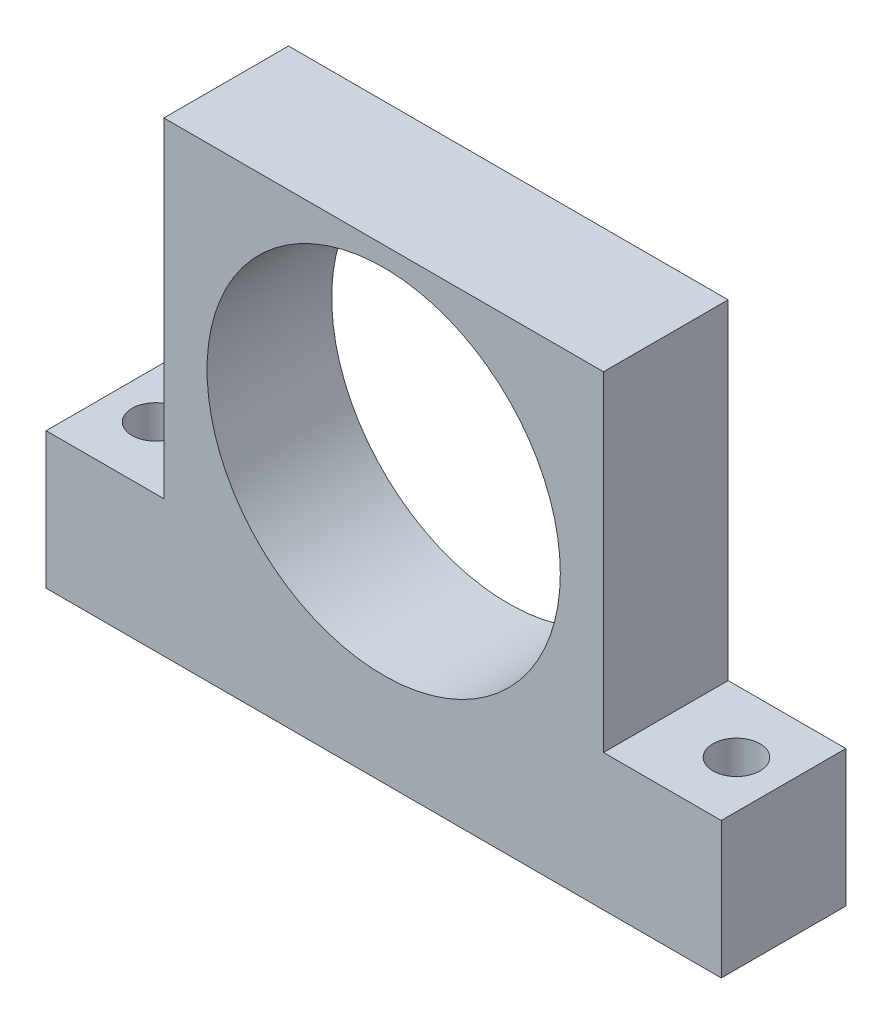
ISO-10303-21;
HEADER;
FILE_DESCRIPTION(('STEP AP214'),'2;1');
FILE_NAME('part.step','',(''),(''),'','','');
FILE_SCHEMA(('AUTOMOTIVE_DESIGN { 1 0 10303 214 1 1 1 1 }'));
ENDSEC;
DATA;
#1=APPLICATION_CONTEXT('core data for automotive mechanical design processes');
#2=APPLICATION_PROTOCOL_DEFINITION('international standard','automotive_design',2000,#1);
#3=PRODUCT_CONTEXT('',#1,'mechanical');
#4=PRODUCT('Part','Part','',(#3));
#5=PRODUCT_RELATED_PRODUCT_CATEGORY('part','',(#4));
#6=PRODUCT_DEFINITION_FORMATION('','',#4);
#7=PRODUCT_DEFINITION_CONTEXT('part definition',#1,'design');
#8=PRODUCT_DEFINITION('design','',#6,#7);
#9=PRODUCT_DEFINITION_SHAPE('','',#8);
#10=(LENGTH_UNIT() NAMED_UNIT(*) SI_UNIT(.MILLI.,.METRE.));
#11=(NAMED_UNIT(*) PLANE_ANGLE_UNIT() SI_UNIT($,.RADIAN.));
#12=(NAMED_UNIT(*) SI_UNIT($,.STERADIAN.) SOLID_ANGLE_UNIT());
#13=UNCERTAINTY_MEASURE_WITH_UNIT(LENGTH_MEASURE(1.E-05),#10,'distance_accuracy_value','');
#14=(GEOMETRIC_REPRESENTATION_CONTEXT(3) GLOBAL_UNCERTAINTY_ASSIGNED_CONTEXT((#13)) GLOBAL_UNIT_ASSIGNED_CONTEXT((#10,
#11,#12)) REPRESENTATION_CONTEXT('',''));
#15=CARTESIAN_POINT('',(0.,0.,0.));
#16=DIRECTION('',(0.,0.,1.));
#17=DIRECTION('',(1.,0.,0.));
#18=AXIS2_PLACEMENT_3D('',#15,#16,#17);
#19=CARTESIAN_POINT('',(0.,-5.56521739130435,0.));
#20=DIRECTION('',(0.,0.,-1.));
#21=DIRECTION('',(1.,0.,0.));
#22=AXIS2_PLACEMENT_3D('',#19,#20,#21);
#23=PLANE('',#22);
#24=CARTESIAN_POINT('',(0.,0.,0.));
#25=DIRECTION('',(0.,0.,1.));
#26=DIRECTION('',(1.,0.,0.));
#27=AXIS2_PLACEMENT_3D('',#24,#25,#26);
#28=CIRCLE('',#27,22.5);
#29=CARTESIAN_POINT('',(22.5,0.,0.));
#30=VERTEX_POINT('',#29);
#31=EDGE_CURVE('E209',#30,#30,#28,.T.);
#32=ORIENTED_EDGE('',*,*,#31,.F.);
#33=EDGE_LOOP('',(#32));
#34=FACE_BOUND('',#33,.T.);
#35=DIRECTION('',(0.,-1.,0.));
#36=VECTOR('',#35,1.);
#37=CARTESIAN_POINT('',(-28.,0.,0.));
#38=LINE('',#37,#36);
#39=CARTESIAN_POINT('',(-28.,25.,0.));
#40=VERTEX_POINT('',#39);
#41=CARTESIAN_POINT('',(-28.,-17.,0.));
#42=VERTEX_POINT('',#41);
#43=EDGE_CURVE('E47',#40,#42,#38,.T.);
#44=ORIENTED_EDGE('',*,*,#43,.T.);
#45=DIRECTION('',(-1.,0.,0.));
#46=VECTOR('',#45,1.);
#47=CARTESIAN_POINT('',(-28.,-17.,0.));
#48=LINE('',#47,#46);
#49=CARTESIAN_POINT('',(-43.,-17.,0.));
#50=VERTEX_POINT('',#49);
#51=EDGE_CURVE('E147',#42,#50,#48,.T.);
#52=ORIENTED_EDGE('',*,*,#51,.T.);
#53=DIRECTION('',(0.,-1.,0.));
#54=VECTOR('',#53,1.);
#55=CARTESIAN_POINT('',(-43.,-17.,0.));
#56=LINE('',#55,#54);
#57=CARTESIAN_POINT('',(-43.,-34.375,0.));
#58=VERTEX_POINT('',#57);
#59=EDGE_CURVE('E128',#50,#58,#56,.T.);
#60=ORIENTED_EDGE('',*,*,#59,.T.);
#61=DIRECTION('',(1.,0.,0.));
#62=VECTOR('',#61,1.);
#63=CARTESIAN_POINT('',(-43.,-34.375,0.));
#64=LINE('',#63,#62);
#65=CARTESIAN_POINT('',(43.,-34.375,0.));
#66=VERTEX_POINT('',#65);
#67=EDGE_CURVE('E135',#58,#66,#64,.T.);
#68=ORIENTED_EDGE('',*,*,#67,.T.);
#69=DIRECTION('',(0.,1.,0.));
#70=VECTOR('',#69,1.);
#71=CARTESIAN_POINT('',(43.,-27.,0.));
#72=LINE('',#71,#70);
#73=CARTESIAN_POINT('',(43.,-17.,0.));
#74=VERTEX_POINT('',#73);
#75=EDGE_CURVE('E151',#66,#74,#72,.T.);
#76=ORIENTED_EDGE('',*,*,#75,.T.);
#77=DIRECTION('',(-1.,0.,0.));
#78=VECTOR('',#77,1.);
#79=CARTESIAN_POINT('',(43.,-17.,0.));
#80=LINE('',#79,#78);
#81=CARTESIAN_POINT('',(28.,-17.,0.));
#82=VERTEX_POINT('',#81);
#83=EDGE_CURVE('E176',#74,#82,#80,.T.);
#84=ORIENTED_EDGE('',*,*,#83,.T.);
#85=DIRECTION('',(0.,1.,0.));
#86=VECTOR('',#85,1.);
#87=CARTESIAN_POINT('',(28.,-17.,0.));
#88=LINE('',#87,#86);
#89=CARTESIAN_POINT('',(28.,25.,0.));
#90=VERTEX_POINT('',#89);
#91=EDGE_CURVE('E164',#82,#90,#88,.T.);
#92=ORIENTED_EDGE('',*,*,#91,.T.);
#93=DIRECTION('',(-1.,0.,0.));
#94=VECTOR('',#93,1.);
#95=CARTESIAN_POINT('',(28.,25.,0.));
#96=LINE('',#95,#94);
#97=EDGE_CURVE('E167',#90,#40,#96,.T.);
#98=ORIENTED_EDGE('',*,*,#97,.T.);
#99=EDGE_LOOP('',(#44,#52,#60,#68,#76,#84,#92,#98));
#100=FACE_BOUND('',#99,.T.);
#101=ADVANCED_FACE('F37',(#34,#100),#23,.F.);
#102=CARTESIAN_POINT('',(0.,-5.56521739130435,-15.875));
#103=DIRECTION('',(0.,0.,-1.));
#104=DIRECTION('',(1.,0.,0.));
#105=AXIS2_PLACEMENT_3D('',#102,#103,#104);
#106=PLANE('',#105);
#107=DIRECTION('',(0.,-1.,0.));
#108=VECTOR('',#107,1.);
#109=CARTESIAN_POINT('',(-28.,25.,-15.875));
#110=LINE('',#109,#108);
#111=CARTESIAN_POINT('',(-28.,25.,-15.875));
#112=VERTEX_POINT('',#111);
#113=CARTESIAN_POINT('',(-28.,-17.,-15.875));
#114=VERTEX_POINT('',#113);
#115=EDGE_CURVE('E11',#112,#114,#110,.T.);
#116=ORIENTED_EDGE('',*,*,#115,.F.);
#117=DIRECTION('',(-1.,0.,0.));
#118=VECTOR('',#117,1.);
#119=CARTESIAN_POINT('',(28.,25.,-15.875));
#120=LINE('',#119,#118);
#121=CARTESIAN_POINT('',(28.,25.,-15.875));
#122=VERTEX_POINT('',#121);
#123=EDGE_CURVE('E158',#122,#112,#120,.T.);
#124=ORIENTED_EDGE('',*,*,#123,.F.);
#125=DIRECTION('',(0.,1.,0.));
#126=VECTOR('',#125,1.);
#127=CARTESIAN_POINT('',(28.,-17.,-15.875));
#128=LINE('',#127,#126);
#129=CARTESIAN_POINT('',(28.,-17.,-15.875));
#130=VERTEX_POINT('',#129);
#131=EDGE_CURVE('E170',#130,#122,#128,.T.);
#132=ORIENTED_EDGE('',*,*,#131,.F.);
#133=DIRECTION('',(-1.,0.,0.));
#134=VECTOR('',#133,1.);
#135=CARTESIAN_POINT('',(43.,-17.,-15.875));
#136=LINE('',#135,#134);
#137=CARTESIAN_POINT('',(43.,-17.,-15.875));
#138=VERTEX_POINT('',#137);
#139=EDGE_CURVE('E156',#138,#130,#136,.T.);
#140=ORIENTED_EDGE('',*,*,#139,.F.);
#141=DIRECTION('',(0.,1.,0.));
#142=VECTOR('',#141,1.);
#143=CARTESIAN_POINT('',(43.,-27.,-15.875));
#144=LINE('',#143,#142);
#145=CARTESIAN_POINT('',(43.,-34.375,-15.875));
#146=VERTEX_POINT('',#145);
#147=EDGE_CURVE('E148',#146,#138,#144,.T.);
#148=ORIENTED_EDGE('',*,*,#147,.F.);
#149=DIRECTION('',(-1.,0.,0.));
#150=VECTOR('',#149,1.);
#151=CARTESIAN_POINT('',(43.,-34.375,-15.875));
#152=LINE('',#151,#150);
#153=CARTESIAN_POINT('',(-43.,-34.375,-15.875));
#154=VERTEX_POINT('',#153);
#155=EDGE_CURVE('E212',#146,#154,#152,.T.);
#156=ORIENTED_EDGE('',*,*,#155,.T.);
#157=DIRECTION('',(0.,-1.,0.));
#158=VECTOR('',#157,1.);
#159=CARTESIAN_POINT('',(-43.,-17.,-15.875));
#160=LINE('',#159,#158);
#161=CARTESIAN_POINT('',(-43.,-17.,-15.875));
#162=VERTEX_POINT('',#161);
#163=EDGE_CURVE('E131',#162,#154,#160,.T.);
#164=ORIENTED_EDGE('',*,*,#163,.F.);
#165=DIRECTION('',(-1.,0.,0.));
#166=VECTOR('',#165,1.);
#167=CARTESIAN_POINT('',(-28.,-17.,-15.875));
#168=LINE('',#167,#166);
#169=EDGE_CURVE('E169',#114,#162,#168,.T.);
#170=ORIENTED_EDGE('',*,*,#169,.F.);
#171=EDGE_LOOP('',(#116,#124,#132,#140,#148,#156,#164,#170));
#172=FACE_BOUND('',#171,.T.);
#173=CARTESIAN_POINT('',(0.,0.,-15.875));
#174=DIRECTION('',(0.,0.,1.));
#175=DIRECTION('',(1.,0.,0.));
#176=AXIS2_PLACEMENT_3D('',#173,#174,#175);
#177=CIRCLE('',#176,22.5);
#178=CARTESIAN_POINT('',(22.5,0.,-15.875));
#179=VERTEX_POINT('',#178);
#180=EDGE_CURVE('E184',#179,#179,#177,.T.);
#181=ORIENTED_EDGE('',*,*,#180,.T.);
#182=EDGE_LOOP('',(#181));
#183=FACE_BOUND('',#182,.T.);
#184=ADVANCED_FACE('F235',(#172,#183),#106,.T.);
#185=CARTESIAN_POINT('',(-28.,0.,0.));
#186=DIRECTION('',(-1.,0.,0.));
#187=DIRECTION('',(0.,0.,-1.));
#188=AXIS2_PLACEMENT_3D('',#185,#186,#187);
#189=PLANE('',#188);
#190=ORIENTED_EDGE('',*,*,#43,.F.);
#191=DIRECTION('',(0.,0.,-1.));
#192=VECTOR('',#191,1.);
#193=CARTESIAN_POINT('',(-28.,25.,0.));
#194=LINE('',#193,#192);
#195=EDGE_CURVE('E162',#40,#112,#194,.T.);
#196=ORIENTED_EDGE('',*,*,#195,.T.);
#197=ORIENTED_EDGE('',*,*,#115,.T.);
#198=DIRECTION('',(0.,0.,-1.));
#199=VECTOR('',#198,1.);
#200=CARTESIAN_POINT('',(-28.,-17.,0.));
#201=LINE('',#200,#199);
#202=EDGE_CURVE('E56',#42,#114,#201,.T.);
#203=ORIENTED_EDGE('',*,*,#202,.F.);
#204=EDGE_LOOP('',(#190,#196,#197,#203));
#205=FACE_BOUND('',#204,.T.);
#206=ADVANCED_FACE('F202',(#205),#189,.T.);
#207=CARTESIAN_POINT('',(-28.,-17.,0.));
#208=DIRECTION('',(0.,1.,0.));
#209=DIRECTION('',(1.,0.,0.));
#210=AXIS2_PLACEMENT_3D('',#207,#208,#209);
#211=PLANE('',#210);
#212=CARTESIAN_POINT('',(-37.,-17.,-7.9375));
#213=DIRECTION('',(0.,1.,0.));
#214=DIRECTION('',(-1.,0.,0.));
#215=AXIS2_PLACEMENT_3D('',#212,#213,#214);
#216=CIRCLE('',#215,3.);
#217=CARTESIAN_POINT('',(-34.,-17.,-7.9375));
#218=VERTEX_POINT('',#217);
#219=EDGE_CURVE('E174',#218,#218,#216,.T.);
#220=ORIENTED_EDGE('',*,*,#219,.F.);
#221=EDGE_LOOP('',(#220));
#222=FACE_BOUND('',#221,.T.);
#223=ORIENTED_EDGE('',*,*,#51,.F.);
#224=ORIENTED_EDGE('',*,*,#202,.T.);
#225=ORIENTED_EDGE('',*,*,#169,.T.);
#226=DIRECTION('',(0.,0.,-1.));
#227=VECTOR('',#226,1.);
#228=CARTESIAN_POINT('',(-43.,-17.,0.));
#229=LINE('',#228,#227);
#230=EDGE_CURVE('E84',#50,#162,#229,.T.);
#231=ORIENTED_EDGE('',*,*,#230,.F.);
#232=EDGE_LOOP('',(#223,#224,#225,#231));
#233=FACE_BOUND('',#232,.T.);
#234=ADVANCED_FACE('F203',(#222,#233),#211,.T.);
#235=CARTESIAN_POINT('',(-43.,-17.,0.));
#236=DIRECTION('',(-1.,0.,0.));
#237=DIRECTION('',(0.,0.,-1.));
#238=AXIS2_PLACEMENT_3D('',#235,#236,#237);
#239=PLANE('',#238);
#240=ORIENTED_EDGE('',*,*,#59,.F.);
#241=ORIENTED_EDGE('',*,*,#230,.T.);
#242=ORIENTED_EDGE('',*,*,#163,.T.);
#243=DIRECTION('',(0.,0.,1.));
#244=VECTOR('',#243,1.);
#245=CARTESIAN_POINT('',(-43.,-34.375,-15.875));
#246=LINE('',#245,#244);
#247=EDGE_CURVE('E124',#154,#58,#246,.T.);
#248=ORIENTED_EDGE('',*,*,#247,.T.);
#249=EDGE_LOOP('',(#240,#241,#242,#248));
#250=FACE_BOUND('',#249,.T.);
#251=ADVANCED_FACE('F126',(#250),#239,.T.);
#252=CARTESIAN_POINT('',(43.,-27.,0.));
#253=DIRECTION('',(1.,0.,0.));
#254=DIRECTION('',(0.,1.,0.));
#255=AXIS2_PLACEMENT_3D('',#252,#253,#254);
#256=PLANE('',#255);
#257=ORIENTED_EDGE('',*,*,#75,.F.);
#258=DIRECTION('',(0.,0.,-1.));
#259=VECTOR('',#258,1.);
#260=CARTESIAN_POINT('',(43.,-34.375,0.));
#261=LINE('',#260,#259);
#262=EDGE_CURVE('E141',#66,#146,#261,.T.);
#263=ORIENTED_EDGE('',*,*,#262,.T.);
#264=ORIENTED_EDGE('',*,*,#147,.T.);
#265=DIRECTION('',(0.,0.,-1.));
#266=VECTOR('',#265,1.);
#267=CARTESIAN_POINT('',(43.,-17.,0.));
#268=LINE('',#267,#266);
#269=EDGE_CURVE('E92',#74,#138,#268,.T.);
#270=ORIENTED_EDGE('',*,*,#269,.F.);
#271=EDGE_LOOP('',(#257,#263,#264,#270));
#272=FACE_BOUND('',#271,.T.);
#273=ADVANCED_FACE('F39',(#272),#256,.T.);
#274=CARTESIAN_POINT('',(43.,-17.,0.));
#275=DIRECTION('',(0.,1.,0.));
#276=DIRECTION('',(1.,0.,0.));
#277=AXIS2_PLACEMENT_3D('',#274,#275,#276);
#278=PLANE('',#277);
#279=CARTESIAN_POINT('',(37.,-17.,-7.9375));
#280=DIRECTION('',(0.,1.,0.));
#281=DIRECTION('',(-1.,0.,0.));
#282=AXIS2_PLACEMENT_3D('',#279,#280,#281);
#283=CIRCLE('',#282,3.);
#284=CARTESIAN_POINT('',(40.,-17.,-7.9375));
#285=VERTEX_POINT('',#284);
#286=EDGE_CURVE('E182',#285,#285,#283,.T.);
#287=ORIENTED_EDGE('',*,*,#286,.F.);
#288=EDGE_LOOP('',(#287));
#289=FACE_BOUND('',#288,.T.);
#290=ORIENTED_EDGE('',*,*,#83,.F.);
#291=ORIENTED_EDGE('',*,*,#269,.T.);
#292=ORIENTED_EDGE('',*,*,#139,.T.);
#293=DIRECTION('',(0.,0.,-1.));
#294=VECTOR('',#293,1.);
#295=CARTESIAN_POINT('',(28.,-17.,0.));
#296=LINE('',#295,#294);
#297=EDGE_CURVE('E173',#82,#130,#296,.T.);
#298=ORIENTED_EDGE('',*,*,#297,.F.);
#299=EDGE_LOOP('',(#290,#291,#292,#298));
#300=FACE_BOUND('',#299,.T.);
#301=ADVANCED_FACE('F244',(#289,#300),#278,.T.);
#302=CARTESIAN_POINT('',(28.,-17.,0.));
#303=DIRECTION('',(1.,0.,0.));
#304=DIRECTION('',(0.,1.,0.));
#305=AXIS2_PLACEMENT_3D('',#302,#303,#304);
#306=PLANE('',#305);
#307=ORIENTED_EDGE('',*,*,#91,.F.);
#308=ORIENTED_EDGE('',*,*,#297,.T.);
#309=ORIENTED_EDGE('',*,*,#131,.T.);
#310=DIRECTION('',(0.,0.,-1.));
#311=VECTOR('',#310,1.);
#312=CARTESIAN_POINT('',(28.,25.,0.));
#313=LINE('',#312,#311);
#314=EDGE_CURVE('E161',#90,#122,#313,.T.);
#315=ORIENTED_EDGE('',*,*,#314,.F.);
#316=EDGE_LOOP('',(#307,#308,#309,#315));
#317=FACE_BOUND('',#316,.T.);
#318=ADVANCED_FACE('F195',(#317),#306,.T.);
#319=CARTESIAN_POINT('',(28.,25.,0.));
#320=DIRECTION('',(0.,1.,0.));
#321=DIRECTION('',(1.,0.,0.));
#322=AXIS2_PLACEMENT_3D('',#319,#320,#321);
#323=PLANE('',#322);
#324=ORIENTED_EDGE('',*,*,#97,.F.);
#325=ORIENTED_EDGE('',*,*,#314,.T.);
#326=ORIENTED_EDGE('',*,*,#123,.T.);
#327=ORIENTED_EDGE('',*,*,#195,.F.);
#328=EDGE_LOOP('',(#324,#325,#326,#327));
#329=FACE_BOUND('',#328,.T.);
#330=ADVANCED_FACE('F199',(#329),#323,.T.);
#331=CARTESIAN_POINT('',(-37.,-17.,-7.9375));
#332=DIRECTION('',(0.,-1.,0.));
#333=DIRECTION('',(-1.,0.,0.));
#334=AXIS2_PLACEMENT_3D('',#331,#332,#333);
#335=CYLINDRICAL_SURFACE('',#334,3.);
#336=ORIENTED_EDGE('',*,*,#219,.T.);
#337=DIRECTION('',(0.,-1.,0.));
#338=VECTOR('',#337,1.);
#339=CARTESIAN_POINT('',(-34.,-17.,-7.9375));
#340=LINE('',#339,#338);
#341=CARTESIAN_POINT('',(-34.,-27.,-7.9375));
#342=VERTEX_POINT('',#341);
#343=EDGE_CURVE('E109',#218,#342,#340,.T.);
#344=ORIENTED_EDGE('',*,*,#343,.T.);
#345=ORIENTED_EDGE('',*,*,#343,.F.);
#346=EDGE_LOOP('',(#336,#344,#345));
#347=FACE_BOUND('',#346,.T.);
#348=CARTESIAN_POINT('',(-37.,-34.375,-7.9375));
#349=DIRECTION('',(0.,1.,0.));
#350=DIRECTION('',(0.,0.,1.));
#351=AXIS2_PLACEMENT_3D('',#348,#349,#350);
#352=CIRCLE('',#351,2.99999999999999);
#353=CARTESIAN_POINT('',(-37.,-34.375,-4.93750000000001));
#354=VERTEX_POINT('',#353);
#355=EDGE_CURVE('E217',#354,#354,#352,.T.);
#356=ORIENTED_EDGE('',*,*,#355,.F.);
#357=EDGE_LOOP('',(#356));
#358=FACE_BOUND('',#357,.T.);
#359=ADVANCED_FACE('F221',(#347,#358),#335,.F.);
#360=CARTESIAN_POINT('',(37.,-17.,-7.9375));
#361=DIRECTION('',(0.,-1.,0.));
#362=DIRECTION('',(-1.,0.,0.));
#363=AXIS2_PLACEMENT_3D('',#360,#361,#362);
#364=CYLINDRICAL_SURFACE('',#363,3.);
#365=ORIENTED_EDGE('',*,*,#286,.T.);
#366=DIRECTION('',(0.,-1.,0.));
#367=VECTOR('',#366,1.);
#368=CARTESIAN_POINT('',(40.,-17.,-7.9375));
#369=LINE('',#368,#367);
#370=CARTESIAN_POINT('',(40.,-27.,-7.9375));
#371=VERTEX_POINT('',#370);
#372=EDGE_CURVE('E103',#285,#371,#369,.T.);
#373=ORIENTED_EDGE('',*,*,#372,.T.);
#374=ORIENTED_EDGE('',*,*,#372,.F.);
#375=EDGE_LOOP('',(#365,#373,#374));
#376=FACE_BOUND('',#375,.T.);
#377=CARTESIAN_POINT('',(37.,-34.375,-7.9375));
#378=DIRECTION('',(0.,1.,0.));
#379=DIRECTION('',(0.,0.,1.));
#380=AXIS2_PLACEMENT_3D('',#377,#378,#379);
#381=CIRCLE('',#380,3.);
#382=CARTESIAN_POINT('',(37.,-34.375,-4.9375));
#383=VERTEX_POINT('',#382);
#384=EDGE_CURVE('E136',#383,#383,#381,.T.);
#385=ORIENTED_EDGE('',*,*,#384,.F.);
#386=EDGE_LOOP('',(#385));
#387=FACE_BOUND('',#386,.T.);
#388=ADVANCED_FACE('F223',(#376,#387),#364,.F.);
#389=CARTESIAN_POINT('',(0.,0.,0.));
#390=DIRECTION('',(0.,0.,-1.));
#391=DIRECTION('',(1.,0.,0.));
#392=AXIS2_PLACEMENT_3D('',#389,#390,#391);
#393=CYLINDRICAL_SURFACE('',#392,22.5);
#394=ORIENTED_EDGE('',*,*,#180,.F.);
#395=EDGE_LOOP('',(#394));
#396=FACE_BOUND('',#395,.T.);
#397=ORIENTED_EDGE('',*,*,#31,.T.);
#398=EDGE_LOOP('',(#397));
#399=FACE_BOUND('',#398,.T.);
#400=ADVANCED_FACE('F229',(#396,#399),#393,.F.);
#401=CARTESIAN_POINT('',(0.,-34.375,0.));
#402=DIRECTION('',(0.,-1.,0.));
#403=DIRECTION('',(0.,0.,1.));
#404=AXIS2_PLACEMENT_3D('',#401,#402,#403);
#405=PLANE('',#404);
#406=ORIENTED_EDGE('',*,*,#384,.T.);
#407=EDGE_LOOP('',(#406));
#408=FACE_BOUND('',#407,.T.);
#409=ORIENTED_EDGE('',*,*,#247,.F.);
#410=ORIENTED_EDGE('',*,*,#155,.F.);
#411=ORIENTED_EDGE('',*,*,#262,.F.);
#412=ORIENTED_EDGE('',*,*,#67,.F.);
#413=EDGE_LOOP('',(#409,#410,#411,#412));
#414=FACE_BOUND('',#413,.T.);
#415=ORIENTED_EDGE('',*,*,#355,.T.);
#416=EDGE_LOOP('',(#415));
#417=FACE_BOUND('',#416,.T.);
#418=ADVANCED_FACE('F139',(#408,#414,#417),#405,.T.);
#419=CLOSED_SHELL('',(#101,#184,#206,#234,#251,#273,#301,#318,#330,#359,#388,#400,#418));
#420=MANIFOLD_SOLID_BREP('B2',#419);
#421=ADVANCED_BREP_SHAPE_REPRESENTATION('',(#18,#420),#14);
#422=SHAPE_DEFINITION_REPRESENTATION(#9,#421);
ENDSEC;
END-ISO-10303-21;
